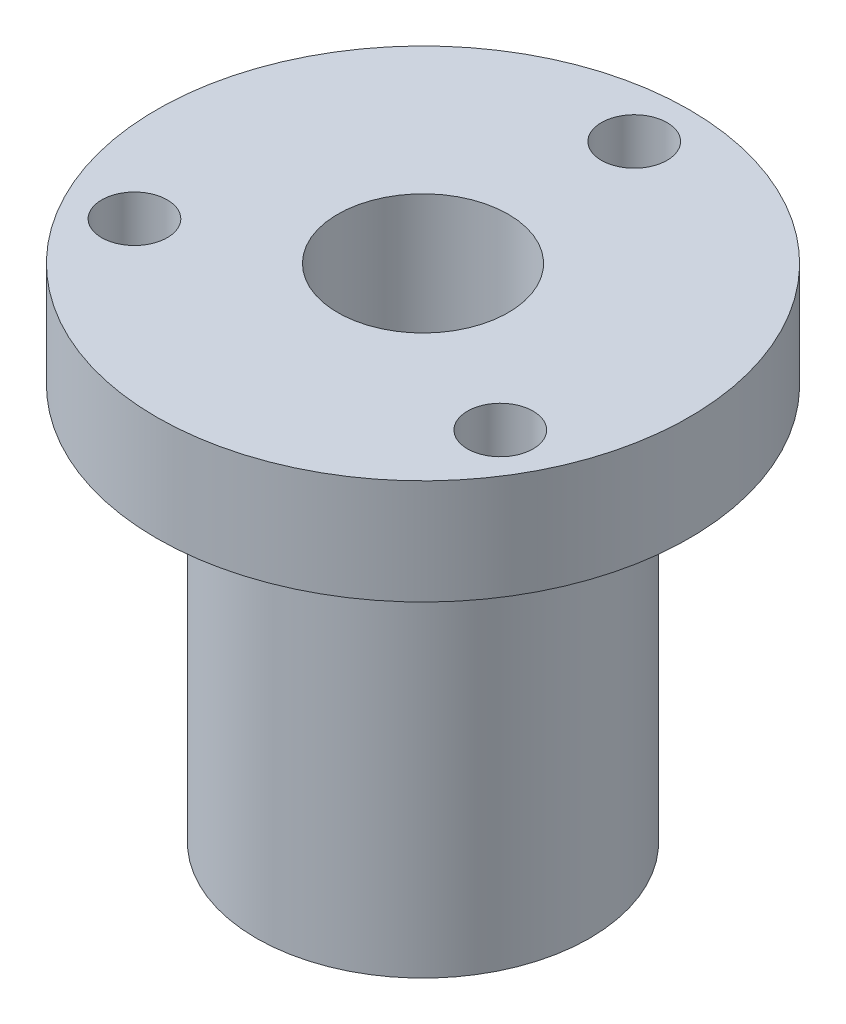
ISO-10303-21;
HEADER;
FILE_DESCRIPTION(('STEP AP214'),'2;1');
FILE_NAME('part.step','',(''),(''),'','','');
FILE_SCHEMA(('AUTOMOTIVE_DESIGN { 1 0 10303 214 1 1 1 1 }'));
ENDSEC;
DATA;
#1=APPLICATION_CONTEXT('core data for automotive mechanical design processes');
#2=APPLICATION_PROTOCOL_DEFINITION('international standard','automotive_design',2000,#1);
#3=PRODUCT_CONTEXT('',#1,'mechanical');
#4=PRODUCT('Part','Part','',(#3));
#5=PRODUCT_RELATED_PRODUCT_CATEGORY('part','',(#4));
#6=PRODUCT_DEFINITION_FORMATION('','',#4);
#7=PRODUCT_DEFINITION_CONTEXT('part definition',#1,'design');
#8=PRODUCT_DEFINITION('design','',#6,#7);
#9=PRODUCT_DEFINITION_SHAPE('','',#8);
#10=(LENGTH_UNIT() NAMED_UNIT(*) SI_UNIT(.MILLI.,.METRE.));
#11=(NAMED_UNIT(*) PLANE_ANGLE_UNIT() SI_UNIT($,.RADIAN.));
#12=(NAMED_UNIT(*) SI_UNIT($,.STERADIAN.) SOLID_ANGLE_UNIT());
#13=UNCERTAINTY_MEASURE_WITH_UNIT(LENGTH_MEASURE(1.E-05),#10,'distance_accuracy_value','');
#14=(GEOMETRIC_REPRESENTATION_CONTEXT(3) GLOBAL_UNCERTAINTY_ASSIGNED_CONTEXT((#13)) GLOBAL_UNIT_ASSIGNED_CONTEXT((#10,
#11,#12)) REPRESENTATION_CONTEXT('',''));
#15=CARTESIAN_POINT('',(0.,0.,0.));
#16=DIRECTION('',(0.,0.,1.));
#17=DIRECTION('',(1.,0.,0.));
#18=AXIS2_PLACEMENT_3D('',#15,#16,#17);
#19=CARTESIAN_POINT('',(3.25,0.,0.));
#20=DIRECTION('',(0.,-1.,0.));
#21=DIRECTION('',(0.,0.,-1.));
#22=AXIS2_PLACEMENT_3D('',#19,#20,#21);
#23=PLANE('',#22);
#24=CARTESIAN_POINT('',(0.,0.,0.));
#25=DIRECTION('',(0.,-1.,0.));
#26=DIRECTION('',(0.,0.,-1.));
#27=AXIS2_PLACEMENT_3D('',#24,#25,#26);
#28=CIRCLE('',#27,6.35);
#29=CARTESIAN_POINT('',(0.,0.,-6.35));
#30=VERTEX_POINT('',#29);
#31=EDGE_CURVE('E10',#30,#30,#28,.T.);
#32=ORIENTED_EDGE('',*,*,#31,.T.);
#33=EDGE_LOOP('',(#32));
#34=FACE_BOUND('',#33,.T.);
#35=CARTESIAN_POINT('',(0.,0.,0.));
#36=DIRECTION('',(0.,-1.,0.));
#37=DIRECTION('',(0.,0.,-1.));
#38=AXIS2_PLACEMENT_3D('',#35,#36,#37);
#39=CIRCLE('',#38,3.25);
#40=CARTESIAN_POINT('',(0.,0.,-3.25));
#41=VERTEX_POINT('',#40);
#42=EDGE_CURVE('E56',#41,#41,#39,.T.);
#43=ORIENTED_EDGE('',*,*,#42,.F.);
#44=EDGE_LOOP('',(#43));
#45=FACE_BOUND('',#44,.T.);
#46=ADVANCED_FACE('F34',(#34,#45),#23,.T.);
#47=CARTESIAN_POINT('',(0.,0.,0.));
#48=DIRECTION('',(0.,-1.,0.));
#49=DIRECTION('',(0.,0.,-1.));
#50=AXIS2_PLACEMENT_3D('',#47,#48,#49);
#51=CYLINDRICAL_SURFACE('',#50,6.35);
#52=CARTESIAN_POINT('',(0.,15.1,0.));
#53=DIRECTION('',(0.,-1.,0.));
#54=DIRECTION('',(0.,0.,-1.));
#55=AXIS2_PLACEMENT_3D('',#52,#53,#54);
#56=CIRCLE('',#55,6.35);
#57=CARTESIAN_POINT('',(0.,15.1,-6.35));
#58=VERTEX_POINT('',#57);
#59=EDGE_CURVE('E40',#58,#58,#56,.T.);
#60=ORIENTED_EDGE('',*,*,#59,.T.);
#61=EDGE_LOOP('',(#60));
#62=FACE_BOUND('',#61,.T.);
#63=ORIENTED_EDGE('',*,*,#31,.F.);
#64=EDGE_LOOP('',(#63));
#65=FACE_BOUND('',#64,.T.);
#66=ADVANCED_FACE('F102',(#62,#65),#51,.T.);
#67=CARTESIAN_POINT('',(6.35,15.1,0.));
#68=DIRECTION('',(0.,-1.,0.));
#69=DIRECTION('',(0.,0.,-1.));
#70=AXIS2_PLACEMENT_3D('',#67,#68,#69);
#71=PLANE('',#70);
#72=CARTESIAN_POINT('',(-6.97150450046471,15.1,4.02500000000004));
#73=DIRECTION('',(0.,-1.,0.));
#74=DIRECTION('',(0.,0.,-1.));
#75=AXIS2_PLACEMENT_3D('',#72,#73,#74);
#76=CIRCLE('',#75,1.25);
#77=CARTESIAN_POINT('',(-6.97150450046471,15.1,2.77500000000004));
#78=VERTEX_POINT('',#77);
#79=EDGE_CURVE('E72',#78,#78,#76,.F.);
#80=ORIENTED_EDGE('',*,*,#79,.T.);
#81=EDGE_LOOP('',(#80));
#82=FACE_BOUND('',#81,.T.);
#83=CARTESIAN_POINT('',(6.97150450046474,15.1,4.02499999999998));
#84=DIRECTION('',(0.,-1.,0.));
#85=DIRECTION('',(0.,0.,-1.));
#86=AXIS2_PLACEMENT_3D('',#83,#84,#85);
#87=CIRCLE('',#86,1.25);
#88=CARTESIAN_POINT('',(6.97150450046474,15.1,2.77499999999999));
#89=VERTEX_POINT('',#88);
#90=EDGE_CURVE('E66',#89,#89,#87,.F.);
#91=ORIENTED_EDGE('',*,*,#90,.T.);
#92=EDGE_LOOP('',(#91));
#93=FACE_BOUND('',#92,.T.);
#94=CARTESIAN_POINT('',(0.,15.1,-8.05));
#95=DIRECTION('',(0.,-1.,0.));
#96=DIRECTION('',(0.,0.,-1.));
#97=AXIS2_PLACEMENT_3D('',#94,#95,#96);
#98=CIRCLE('',#97,1.25);
#99=CARTESIAN_POINT('',(0.,15.1,-9.3));
#100=VERTEX_POINT('',#99);
#101=EDGE_CURVE('E60',#100,#100,#98,.F.);
#102=ORIENTED_EDGE('',*,*,#101,.T.);
#103=EDGE_LOOP('',(#102));
#104=FACE_BOUND('',#103,.T.);
#105=CARTESIAN_POINT('',(0.,15.1,0.));
#106=DIRECTION('',(0.,-1.,0.));
#107=DIRECTION('',(0.,0.,-1.));
#108=AXIS2_PLACEMENT_3D('',#105,#106,#107);
#109=CIRCLE('',#108,10.15);
#110=CARTESIAN_POINT('',(0.,15.1,-10.15));
#111=VERTEX_POINT('',#110);
#112=EDGE_CURVE('E44',#111,#111,#109,.T.);
#113=ORIENTED_EDGE('',*,*,#112,.T.);
#114=EDGE_LOOP('',(#113));
#115=FACE_BOUND('',#114,.T.);
#116=ORIENTED_EDGE('',*,*,#59,.F.);
#117=EDGE_LOOP('',(#116));
#118=FACE_BOUND('',#117,.T.);
#119=ADVANCED_FACE('F96',(#82,#93,#104,#115,#118),#71,.T.);
#120=CARTESIAN_POINT('',(0.,0.,0.));
#121=DIRECTION('',(0.,-1.,0.));
#122=DIRECTION('',(0.,0.,-1.));
#123=AXIS2_PLACEMENT_3D('',#120,#121,#122);
#124=CYLINDRICAL_SURFACE('',#123,10.15);
#125=CARTESIAN_POINT('',(0.,19.1,0.));
#126=DIRECTION('',(0.,-1.,0.));
#127=DIRECTION('',(0.,0.,-1.));
#128=AXIS2_PLACEMENT_3D('',#125,#126,#127);
#129=CIRCLE('',#128,10.15);
#130=CARTESIAN_POINT('',(0.,19.1,-10.15));
#131=VERTEX_POINT('',#130);
#132=EDGE_CURVE('E48',#131,#131,#129,.T.);
#133=ORIENTED_EDGE('',*,*,#132,.T.);
#134=EDGE_LOOP('',(#133));
#135=FACE_BOUND('',#134,.T.);
#136=ORIENTED_EDGE('',*,*,#112,.F.);
#137=EDGE_LOOP('',(#136));
#138=FACE_BOUND('',#137,.T.);
#139=ADVANCED_FACE('F84',(#135,#138),#124,.T.);
#140=CARTESIAN_POINT('',(10.15,19.1,0.));
#141=DIRECTION('',(0.,1.,0.));
#142=DIRECTION('',(0.,0.,1.));
#143=AXIS2_PLACEMENT_3D('',#140,#141,#142);
#144=PLANE('',#143);
#145=CARTESIAN_POINT('',(-6.97150450046471,19.1,4.02500000000004));
#146=DIRECTION('',(0.,1.,0.));
#147=DIRECTION('',(0.,0.,1.));
#148=AXIS2_PLACEMENT_3D('',#145,#146,#147);
#149=CIRCLE('',#148,1.25);
#150=CARTESIAN_POINT('',(-6.97150450046471,19.1,5.27500000000004));
#151=VERTEX_POINT('',#150);
#152=EDGE_CURVE('E69',#151,#151,#149,.T.);
#153=ORIENTED_EDGE('',*,*,#152,.F.);
#154=EDGE_LOOP('',(#153));
#155=FACE_BOUND('',#154,.T.);
#156=CARTESIAN_POINT('',(6.97150450046474,19.1,4.02499999999998));
#157=DIRECTION('',(0.,1.,0.));
#158=DIRECTION('',(0.,0.,1.));
#159=AXIS2_PLACEMENT_3D('',#156,#157,#158);
#160=CIRCLE('',#159,1.25);
#161=CARTESIAN_POINT('',(6.97150450046474,19.1,5.27499999999998));
#162=VERTEX_POINT('',#161);
#163=EDGE_CURVE('E63',#162,#162,#160,.T.);
#164=ORIENTED_EDGE('',*,*,#163,.F.);
#165=EDGE_LOOP('',(#164));
#166=FACE_BOUND('',#165,.T.);
#167=CARTESIAN_POINT('',(0.,19.1,-8.05));
#168=DIRECTION('',(0.,1.,0.));
#169=DIRECTION('',(0.,0.,1.));
#170=AXIS2_PLACEMENT_3D('',#167,#168,#169);
#171=CIRCLE('',#170,1.25);
#172=CARTESIAN_POINT('',(0.,19.1,-6.8));
#173=VERTEX_POINT('',#172);
#174=EDGE_CURVE('E59',#173,#173,#171,.T.);
#175=ORIENTED_EDGE('',*,*,#174,.F.);
#176=EDGE_LOOP('',(#175));
#177=FACE_BOUND('',#176,.T.);
#178=CARTESIAN_POINT('',(0.,19.1,0.));
#179=DIRECTION('',(0.,-1.,0.));
#180=DIRECTION('',(0.,0.,-1.));
#181=AXIS2_PLACEMENT_3D('',#178,#179,#180);
#182=CIRCLE('',#181,3.25);
#183=CARTESIAN_POINT('',(0.,19.1,-3.25));
#184=VERTEX_POINT('',#183);
#185=EDGE_CURVE('E53',#184,#184,#182,.T.);
#186=ORIENTED_EDGE('',*,*,#185,.T.);
#187=EDGE_LOOP('',(#186));
#188=FACE_BOUND('',#187,.T.);
#189=ORIENTED_EDGE('',*,*,#132,.F.);
#190=EDGE_LOOP('',(#189));
#191=FACE_BOUND('',#190,.T.);
#192=ADVANCED_FACE('F80',(#155,#166,#177,#188,#191),#144,.T.);
#193=CARTESIAN_POINT('',(0.,0.,0.));
#194=DIRECTION('',(0.,-1.,0.));
#195=DIRECTION('',(0.,0.,-1.));
#196=AXIS2_PLACEMENT_3D('',#193,#194,#195);
#197=CYLINDRICAL_SURFACE('',#196,3.25);
#198=ORIENTED_EDGE('',*,*,#42,.T.);
#199=EDGE_LOOP('',(#198));
#200=FACE_BOUND('',#199,.T.);
#201=ORIENTED_EDGE('',*,*,#185,.F.);
#202=EDGE_LOOP('',(#201));
#203=FACE_BOUND('',#202,.T.);
#204=ADVANCED_FACE('F83',(#200,#203),#197,.F.);
#205=CARTESIAN_POINT('',(0.,-0.001000000000001,-8.05));
#206=DIRECTION('',(0.,1.,0.));
#207=DIRECTION('',(0.,0.,1.));
#208=AXIS2_PLACEMENT_3D('',#205,#206,#207);
#209=CYLINDRICAL_SURFACE('',#208,1.25);
#210=ORIENTED_EDGE('',*,*,#101,.F.);
#211=EDGE_LOOP('',(#210));
#212=FACE_BOUND('',#211,.T.);
#213=ORIENTED_EDGE('',*,*,#174,.T.);
#214=EDGE_LOOP('',(#213));
#215=FACE_BOUND('',#214,.T.);
#216=ADVANCED_FACE('F117',(#212,#215),#209,.F.);
#217=CARTESIAN_POINT('',(6.97150450046474,-0.001000000000001,4.02499999999998));
#218=DIRECTION('',(0.,1.,0.));
#219=DIRECTION('',(0.,0.,1.));
#220=AXIS2_PLACEMENT_3D('',#217,#218,#219);
#221=CYLINDRICAL_SURFACE('',#220,1.25);
#222=ORIENTED_EDGE('',*,*,#90,.F.);
#223=EDGE_LOOP('',(#222));
#224=FACE_BOUND('',#223,.T.);
#225=ORIENTED_EDGE('',*,*,#163,.T.);
#226=EDGE_LOOP('',(#225));
#227=FACE_BOUND('',#226,.T.);
#228=ADVANCED_FACE('F122',(#224,#227),#221,.F.);
#229=CARTESIAN_POINT('',(-6.97150450046471,-0.001000000000001,4.02500000000004));
#230=DIRECTION('',(0.,1.,0.));
#231=DIRECTION('',(0.,0.,1.));
#232=AXIS2_PLACEMENT_3D('',#229,#230,#231);
#233=CYLINDRICAL_SURFACE('',#232,1.25);
#234=ORIENTED_EDGE('',*,*,#79,.F.);
#235=EDGE_LOOP('',(#234));
#236=FACE_BOUND('',#235,.T.);
#237=ORIENTED_EDGE('',*,*,#152,.T.);
#238=EDGE_LOOP('',(#237));
#239=FACE_BOUND('',#238,.T.);
#240=ADVANCED_FACE('F78',(#236,#239),#233,.F.);
#241=CLOSED_SHELL('',(#46,#66,#119,#139,#192,#204,#216,#228,#240));
#242=MANIFOLD_SOLID_BREP('B2',#241);
#243=ADVANCED_BREP_SHAPE_REPRESENTATION('',(#18,#242),#14);
#244=SHAPE_DEFINITION_REPRESENTATION(#9,#243);
ENDSEC;
END-ISO-10303-21;
